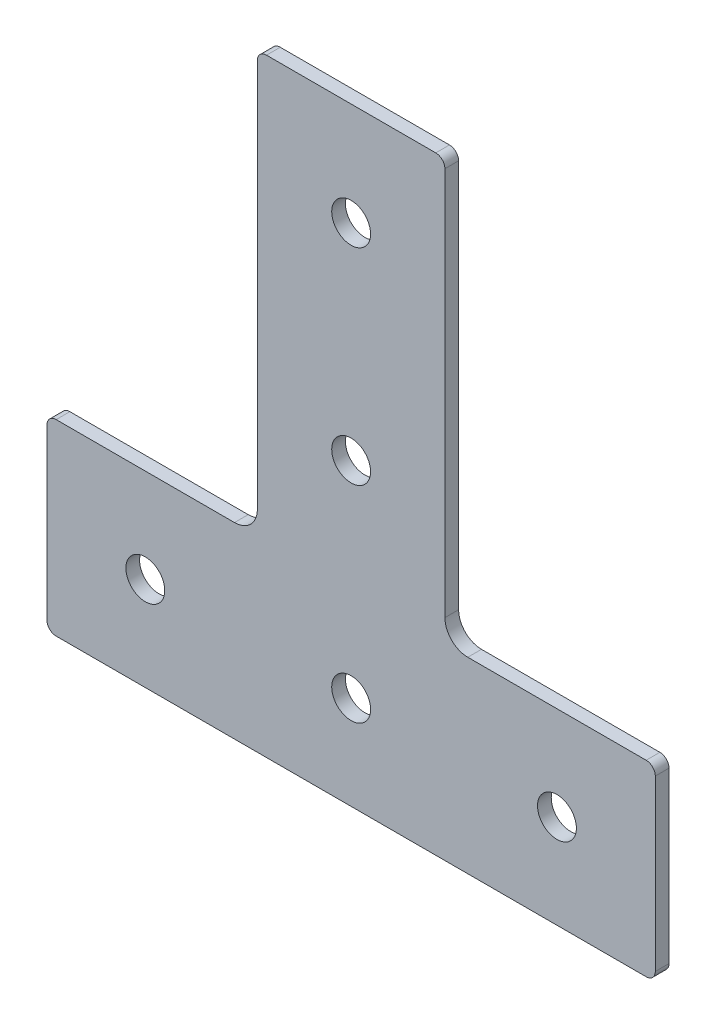
ISO-10303-21;
HEADER;
FILE_DESCRIPTION(('STEP AP214'),'2;1');
FILE_NAME('part.step','',(''),(''),'','','');
FILE_SCHEMA(('AUTOMOTIVE_DESIGN { 1 0 10303 214 1 1 1 1 }'));
ENDSEC;
DATA;
#1=APPLICATION_CONTEXT('core data for automotive mechanical design processes');
#2=APPLICATION_PROTOCOL_DEFINITION('international standard','automotive_design',2000,#1);
#3=PRODUCT_CONTEXT('',#1,'mechanical');
#4=PRODUCT('Part','Part','',(#3));
#5=PRODUCT_RELATED_PRODUCT_CATEGORY('part','',(#4));
#6=PRODUCT_DEFINITION_FORMATION('','',#4);
#7=PRODUCT_DEFINITION_CONTEXT('part definition',#1,'design');
#8=PRODUCT_DEFINITION('design','',#6,#7);
#9=PRODUCT_DEFINITION_SHAPE('','',#8);
#10=(LENGTH_UNIT() NAMED_UNIT(*) SI_UNIT(.MILLI.,.METRE.));
#11=(NAMED_UNIT(*) PLANE_ANGLE_UNIT() SI_UNIT($,.RADIAN.));
#12=(NAMED_UNIT(*) SI_UNIT($,.STERADIAN.) SOLID_ANGLE_UNIT());
#13=UNCERTAINTY_MEASURE_WITH_UNIT(LENGTH_MEASURE(1.E-05),#10,'distance_accuracy_value','');
#14=(GEOMETRIC_REPRESENTATION_CONTEXT(3) GLOBAL_UNCERTAINTY_ASSIGNED_CONTEXT((#13)) GLOBAL_UNIT_ASSIGNED_CONTEXT((#10,
#11,#12)) REPRESENTATION_CONTEXT('',''));
#15=CARTESIAN_POINT('',(0.,0.,0.));
#16=DIRECTION('',(0.,0.,1.));
#17=DIRECTION('',(1.,0.,0.));
#18=AXIS2_PLACEMENT_3D('',#15,#16,#17);
#19=CARTESIAN_POINT('',(-18.5,110.5,0.));
#20=DIRECTION('',(0.,0.,1.));
#21=DIRECTION('',(1.,0.,0.));
#22=AXIS2_PLACEMENT_3D('',#19,#20,#21);
#23=PLANE('',#22);
#24=CARTESIAN_POINT('',(-44.9999999999999,0.,0.));
#25=DIRECTION('',(0.,0.,-1.));
#26=DIRECTION('',(-1.,0.,0.));
#27=AXIS2_PLACEMENT_3D('',#24,#25,#26);
#28=CIRCLE('',#27,4.24999999999986);
#29=CARTESIAN_POINT('',(-49.2499999999998,0.,0.));
#30=VERTEX_POINT('',#29);
#31=EDGE_CURVE('E229',#30,#30,#28,.F.);
#32=ORIENTED_EDGE('',*,*,#31,.T.);
#33=EDGE_LOOP('',(#32));
#34=FACE_BOUND('',#33,.T.);
#35=CARTESIAN_POINT('',(0.,90.,0.));
#36=DIRECTION('',(0.,0.,-1.));
#37=DIRECTION('',(-1.,0.,0.));
#38=AXIS2_PLACEMENT_3D('',#35,#36,#37);
#39=CIRCLE('',#38,4.24999999999986);
#40=CARTESIAN_POINT('',(-4.24999999999986,90.,0.));
#41=VERTEX_POINT('',#40);
#42=EDGE_CURVE('E151',#41,#41,#39,.F.);
#43=ORIENTED_EDGE('',*,*,#42,.T.);
#44=EDGE_LOOP('',(#43));
#45=FACE_BOUND('',#44,.T.);
#46=CARTESIAN_POINT('',(0.,0.,0.));
#47=DIRECTION('',(0.,0.,-1.));
#48=DIRECTION('',(-1.,0.,0.));
#49=AXIS2_PLACEMENT_3D('',#46,#47,#48);
#50=CIRCLE('',#49,4.24999999999986);
#51=CARTESIAN_POINT('',(-4.24999999999986,0.,0.));
#52=VERTEX_POINT('',#51);
#53=EDGE_CURVE('E148',#52,#52,#50,.F.);
#54=ORIENTED_EDGE('',*,*,#53,.T.);
#55=EDGE_LOOP('',(#54));
#56=FACE_BOUND('',#55,.T.);
#57=DIRECTION('',(1.,0.,0.));
#58=VECTOR('',#57,1.);
#59=CARTESIAN_POINT('',(-18.5,112.5,0.));
#60=LINE('',#59,#58);
#61=CARTESIAN_POINT('',(-18.5,112.5,0.));
#62=VERTEX_POINT('',#61);
#63=CARTESIAN_POINT('',(18.5,112.5,0.));
#64=VERTEX_POINT('',#63);
#65=EDGE_CURVE('E131',#62,#64,#60,.T.);
#66=ORIENTED_EDGE('',*,*,#65,.T.);
#67=CARTESIAN_POINT('',(18.5,110.5,0.));
#68=DIRECTION('',(0.,0.,-1.));
#69=DIRECTION('',(-1.,0.,0.));
#70=AXIS2_PLACEMENT_3D('',#67,#68,#69);
#71=CIRCLE('',#70,2.00000000000011);
#72=CARTESIAN_POINT('',(20.5000000000001,110.5,0.));
#73=VERTEX_POINT('',#72);
#74=EDGE_CURVE('E159',#73,#64,#71,.F.);
#75=ORIENTED_EDGE('',*,*,#74,.F.);
#76=DIRECTION('',(0.,1.,0.));
#77=VECTOR('',#76,1.);
#78=CARTESIAN_POINT('',(20.5000000000002,110.5,0.));
#79=LINE('',#78,#77);
#80=CARTESIAN_POINT('',(20.5000000000002,25.5,0.));
#81=VERTEX_POINT('',#80);
#82=EDGE_CURVE('E156',#73,#81,#79,.F.);
#83=ORIENTED_EDGE('',*,*,#82,.T.);
#84=CARTESIAN_POINT('',(25.5000000000001,25.5,0.));
#85=DIRECTION('',(0.,0.,-1.));
#86=DIRECTION('',(-1.,0.,0.));
#87=AXIS2_PLACEMENT_3D('',#84,#85,#86);
#88=CIRCLE('',#87,4.99999999999995);
#89=CARTESIAN_POINT('',(25.5000000000001,20.5,0.));
#90=VERTEX_POINT('',#89);
#91=EDGE_CURVE('E236',#81,#90,#88,.F.);
#92=ORIENTED_EDGE('',*,*,#91,.T.);
#93=DIRECTION('',(1.,0.,0.));
#94=VECTOR('',#93,1.);
#95=CARTESIAN_POINT('',(25.5000000000001,20.5,0.));
#96=LINE('',#95,#94);
#97=CARTESIAN_POINT('',(64.5000000000002,20.5,0.));
#98=VERTEX_POINT('',#97);
#99=EDGE_CURVE('E161',#90,#98,#96,.T.);
#100=ORIENTED_EDGE('',*,*,#99,.T.);
#101=CARTESIAN_POINT('',(64.5000000000002,18.5,0.));
#102=DIRECTION('',(0.,0.,-1.));
#103=DIRECTION('',(-1.,0.,0.));
#104=AXIS2_PLACEMENT_3D('',#101,#102,#103);
#105=CIRCLE('',#104,1.99999999999989);
#106=CARTESIAN_POINT('',(66.5000000000001,18.4999999999999,0.));
#107=VERTEX_POINT('',#106);
#108=EDGE_CURVE('E169',#107,#98,#105,.F.);
#109=ORIENTED_EDGE('',*,*,#108,.F.);
#110=DIRECTION('',(0.,-1.,0.));
#111=VECTOR('',#110,1.);
#112=CARTESIAN_POINT('',(66.5,18.5,0.));
#113=LINE('',#112,#111);
#114=CARTESIAN_POINT('',(66.4999999999996,-18.5000000000001,0.));
#115=VERTEX_POINT('',#114);
#116=EDGE_CURVE('E166',#107,#115,#113,.T.);
#117=ORIENTED_EDGE('',*,*,#116,.T.);
#118=CARTESIAN_POINT('',(64.4999999999998,-18.5000000000001,0.));
#119=DIRECTION('',(0.,0.,-1.));
#120=DIRECTION('',(-1.,0.,0.));
#121=AXIS2_PLACEMENT_3D('',#118,#119,#120);
#122=CIRCLE('',#121,1.99999999999989);
#123=CARTESIAN_POINT('',(64.4999999999998,-20.5,0.));
#124=VERTEX_POINT('',#123);
#125=EDGE_CURVE('E174',#124,#115,#122,.F.);
#126=ORIENTED_EDGE('',*,*,#125,.F.);
#127=DIRECTION('',(1.,0.,0.));
#128=VECTOR('',#127,1.);
#129=CARTESIAN_POINT('',(-64.4999999999998,-20.5000000000001,0.));
#130=LINE('',#129,#128);
#131=CARTESIAN_POINT('',(-64.4999999999998,-20.5000000000001,0.));
#132=VERTEX_POINT('',#131);
#133=EDGE_CURVE('E171',#124,#132,#130,.F.);
#134=ORIENTED_EDGE('',*,*,#133,.T.);
#135=CARTESIAN_POINT('',(-64.4999999999998,-18.5000000000001,0.));
#136=DIRECTION('',(0.,0.,-1.));
#137=DIRECTION('',(-1.,0.,0.));
#138=AXIS2_PLACEMENT_3D('',#135,#136,#137);
#139=CIRCLE('',#138,2.00000000000011);
#140=CARTESIAN_POINT('',(-66.4999999999999,-18.5000000000001,0.));
#141=VERTEX_POINT('',#140);
#142=EDGE_CURVE('E179',#141,#132,#139,.F.);
#143=ORIENTED_EDGE('',*,*,#142,.F.);
#144=DIRECTION('',(0.,1.,0.));
#145=VECTOR('',#144,1.);
#146=CARTESIAN_POINT('',(-66.5,18.5,0.));
#147=LINE('',#146,#145);
#148=CARTESIAN_POINT('',(-66.5,18.5,0.));
#149=VERTEX_POINT('',#148);
#150=EDGE_CURVE('E176',#141,#149,#147,.T.);
#151=ORIENTED_EDGE('',*,*,#150,.T.);
#152=CARTESIAN_POINT('',(-64.4999999999998,18.5,0.));
#153=DIRECTION('',(0.,0.,-1.));
#154=DIRECTION('',(-1.,0.,0.));
#155=AXIS2_PLACEMENT_3D('',#152,#153,#154);
#156=CIRCLE('',#155,2.00000000000011);
#157=CARTESIAN_POINT('',(-64.4999999999998,20.5,0.));
#158=VERTEX_POINT('',#157);
#159=EDGE_CURVE('E184',#158,#149,#156,.F.);
#160=ORIENTED_EDGE('',*,*,#159,.F.);
#161=DIRECTION('',(1.,0.,0.));
#162=VECTOR('',#161,1.);
#163=CARTESIAN_POINT('',(-64.4999999999998,20.5,0.));
#164=LINE('',#163,#162);
#165=CARTESIAN_POINT('',(-25.4999999999996,20.5,0.));
#166=VERTEX_POINT('',#165);
#167=EDGE_CURVE('E181',#158,#166,#164,.T.);
#168=ORIENTED_EDGE('',*,*,#167,.T.);
#169=CARTESIAN_POINT('',(-25.4999999999996,25.5,0.));
#170=DIRECTION('',(0.,0.,-1.));
#171=DIRECTION('',(-1.,0.,0.));
#172=AXIS2_PLACEMENT_3D('',#169,#170,#171);
#173=CIRCLE('',#172,4.99999999999995);
#174=CARTESIAN_POINT('',(-20.4999999999997,25.5,0.));
#175=VERTEX_POINT('',#174);
#176=EDGE_CURVE('E247',#166,#175,#173,.F.);
#177=ORIENTED_EDGE('',*,*,#176,.T.);
#178=DIRECTION('',(0.,1.,0.));
#179=VECTOR('',#178,1.);
#180=CARTESIAN_POINT('',(-20.4999999999997,110.5,0.));
#181=LINE('',#180,#179);
#182=CARTESIAN_POINT('',(-20.4999999999997,110.5,0.));
#183=VERTEX_POINT('',#182);
#184=EDGE_CURVE('E133',#175,#183,#181,.T.);
#185=ORIENTED_EDGE('',*,*,#184,.T.);
#186=CARTESIAN_POINT('',(-18.5,110.5,0.));
#187=DIRECTION('',(0.,0.,-1.));
#188=DIRECTION('',(-1.,0.,0.));
#189=AXIS2_PLACEMENT_3D('',#186,#187,#188);
#190=CIRCLE('',#189,1.99999999999989);
#191=EDGE_CURVE('E127',#62,#183,#190,.F.);
#192=ORIENTED_EDGE('',*,*,#191,.F.);
#193=EDGE_LOOP('',(#66,#75,#83,#92,#100,#109,#117,#126,#134,#143,#151,#160,#168,#177,#185,#192));
#194=FACE_BOUND('',#193,.T.);
#195=CARTESIAN_POINT('',(0.,44.9999999999999,0.));
#196=DIRECTION('',(0.,0.,-1.));
#197=DIRECTION('',(-1.,0.,0.));
#198=AXIS2_PLACEMENT_3D('',#195,#196,#197);
#199=CIRCLE('',#198,4.24999999999986);
#200=CARTESIAN_POINT('',(-4.24999999999986,44.9999999999999,0.));
#201=VERTEX_POINT('',#200);
#202=EDGE_CURVE('E137',#201,#201,#199,.F.);
#203=ORIENTED_EDGE('',*,*,#202,.T.);
#204=EDGE_LOOP('',(#203));
#205=FACE_BOUND('',#204,.T.);
#206=CARTESIAN_POINT('',(45.0000000000004,0.,0.));
#207=DIRECTION('',(0.,0.,-1.));
#208=DIRECTION('',(-1.,0.,0.));
#209=AXIS2_PLACEMENT_3D('',#206,#207,#208);
#210=CIRCLE('',#209,4.24999999999986);
#211=CARTESIAN_POINT('',(40.7500000000005,0.,0.));
#212=VERTEX_POINT('',#211);
#213=EDGE_CURVE('E19',#212,#212,#210,.F.);
#214=ORIENTED_EDGE('',*,*,#213,.T.);
#215=EDGE_LOOP('',(#214));
#216=FACE_BOUND('',#215,.T.);
#217=ADVANCED_FACE('F16',(#34,#45,#56,#194,#205,#216),#23,.F.);
#218=CARTESIAN_POINT('',(45.0000000000004,0.,3.));
#219=DIRECTION('',(0.,0.,-1.));
#220=DIRECTION('',(-1.,0.,0.));
#221=AXIS2_PLACEMENT_3D('',#218,#219,#220);
#222=CYLINDRICAL_SURFACE('',#221,4.24999999999986);
#223=CARTESIAN_POINT('',(45.0000000000004,0.,3.));
#224=DIRECTION('',(0.,0.,-1.));
#225=DIRECTION('',(-1.,0.,0.));
#226=AXIS2_PLACEMENT_3D('',#223,#224,#225);
#227=CIRCLE('',#226,4.24999999999986);
#228=CARTESIAN_POINT('',(40.7500000000005,0.,3.));
#229=VERTEX_POINT('',#228);
#230=EDGE_CURVE('E226',#229,#229,#227,.T.);
#231=ORIENTED_EDGE('',*,*,#230,.F.);
#232=EDGE_LOOP('',(#231));
#233=FACE_BOUND('',#232,.T.);
#234=ORIENTED_EDGE('',*,*,#213,.F.);
#235=EDGE_LOOP('',(#234));
#236=FACE_BOUND('',#235,.T.);
#237=ADVANCED_FACE('F254',(#233,#236),#222,.F.);
#238=CARTESIAN_POINT('',(0.,44.9999999999999,3.));
#239=DIRECTION('',(0.,0.,-1.));
#240=DIRECTION('',(-1.,0.,0.));
#241=AXIS2_PLACEMENT_3D('',#238,#239,#240);
#242=CYLINDRICAL_SURFACE('',#241,4.24999999999986);
#243=CARTESIAN_POINT('',(0.,44.9999999999999,3.));
#244=DIRECTION('',(0.,0.,-1.));
#245=DIRECTION('',(-1.,0.,0.));
#246=AXIS2_PLACEMENT_3D('',#243,#244,#245);
#247=CIRCLE('',#246,4.24999999999986);
#248=CARTESIAN_POINT('',(-4.24999999999986,44.9999999999999,3.));
#249=VERTEX_POINT('',#248);
#250=EDGE_CURVE('E223',#249,#249,#247,.T.);
#251=ORIENTED_EDGE('',*,*,#250,.F.);
#252=EDGE_LOOP('',(#251));
#253=FACE_BOUND('',#252,.T.);
#254=ORIENTED_EDGE('',*,*,#202,.F.);
#255=EDGE_LOOP('',(#254));
#256=FACE_BOUND('',#255,.T.);
#257=ADVANCED_FACE('F256',(#253,#256),#242,.F.);
#258=CARTESIAN_POINT('',(-18.5,110.5,3.));
#259=DIRECTION('',(0.,0.,-1.));
#260=DIRECTION('',(-1.,0.,0.));
#261=AXIS2_PLACEMENT_3D('',#258,#259,#260);
#262=CYLINDRICAL_SURFACE('',#261,1.99999999999989);
#263=CARTESIAN_POINT('',(-18.5,110.5,3.));
#264=DIRECTION('',(0.,0.,-1.));
#265=DIRECTION('',(-1.,0.,0.));
#266=AXIS2_PLACEMENT_3D('',#263,#264,#265);
#267=CIRCLE('',#266,1.99999999999989);
#268=CARTESIAN_POINT('',(-18.5,112.5,3.));
#269=VERTEX_POINT('',#268);
#270=CARTESIAN_POINT('',(-20.4999999999997,110.5,3.));
#271=VERTEX_POINT('',#270);
#272=EDGE_CURVE('E143',#269,#271,#267,.F.);
#273=ORIENTED_EDGE('',*,*,#272,.F.);
#274=DIRECTION('',(0.,0.,-1.));
#275=VECTOR('',#274,1.);
#276=CARTESIAN_POINT('',(-18.5,112.5,3.));
#277=LINE('',#276,#275);
#278=EDGE_CURVE('E140',#269,#62,#277,.T.);
#279=ORIENTED_EDGE('',*,*,#278,.T.);
#280=ORIENTED_EDGE('',*,*,#191,.T.);
#281=DIRECTION('',(0.,0.,-1.));
#282=VECTOR('',#281,1.);
#283=CARTESIAN_POINT('',(-20.4999999999997,110.5,3.));
#284=LINE('',#283,#282);
#285=EDGE_CURVE('E136',#183,#271,#284,.F.);
#286=ORIENTED_EDGE('',*,*,#285,.T.);
#287=EDGE_LOOP('',(#273,#279,#280,#286));
#288=FACE_BOUND('',#287,.T.);
#289=ADVANCED_FACE('F141',(#288),#262,.T.);
#290=CARTESIAN_POINT('',(-20.4999999999997,110.5,3.));
#291=DIRECTION('',(1.,0.,0.));
#292=DIRECTION('',(0.,0.,-1.));
#293=AXIS2_PLACEMENT_3D('',#290,#291,#292);
#294=PLANE('',#293);
#295=DIRECTION('',(0.,0.,-1.));
#296=VECTOR('',#295,1.);
#297=CARTESIAN_POINT('',(-20.4999999999997,25.5,3.));
#298=LINE('',#297,#296);
#299=CARTESIAN_POINT('',(-20.4999999999997,25.5,3.));
#300=VERTEX_POINT('',#299);
#301=EDGE_CURVE('E186',#175,#300,#298,.F.);
#302=ORIENTED_EDGE('',*,*,#301,.T.);
#303=DIRECTION('',(0.,1.,0.));
#304=VECTOR('',#303,1.);
#305=CARTESIAN_POINT('',(-20.4999999999997,110.5,3.));
#306=LINE('',#305,#304);
#307=EDGE_CURVE('E221',#271,#300,#306,.F.);
#308=ORIENTED_EDGE('',*,*,#307,.F.);
#309=ORIENTED_EDGE('',*,*,#285,.F.);
#310=ORIENTED_EDGE('',*,*,#184,.F.);
#311=EDGE_LOOP('',(#302,#308,#309,#310));
#312=FACE_BOUND('',#311,.T.);
#313=ADVANCED_FACE('F339',(#312),#294,.F.);
#314=CARTESIAN_POINT('',(-25.4999999999996,25.5,3.));
#315=DIRECTION('',(0.,0.,-1.));
#316=DIRECTION('',(-1.,0.,0.));
#317=AXIS2_PLACEMENT_3D('',#314,#315,#316);
#318=CYLINDRICAL_SURFACE('',#317,4.99999999999995);
#319=DIRECTION('',(0.,0.,-1.));
#320=VECTOR('',#319,1.);
#321=CARTESIAN_POINT('',(-25.4999999999996,20.5,3.));
#322=LINE('',#321,#320);
#323=CARTESIAN_POINT('',(-25.4999999999996,20.5,3.));
#324=VERTEX_POINT('',#323);
#325=EDGE_CURVE('E185',#166,#324,#322,.F.);
#326=ORIENTED_EDGE('',*,*,#325,.T.);
#327=CARTESIAN_POINT('',(-25.4999999999996,25.5,3.));
#328=DIRECTION('',(0.,0.,-1.));
#329=DIRECTION('',(-1.,0.,0.));
#330=AXIS2_PLACEMENT_3D('',#327,#328,#329);
#331=CIRCLE('',#330,4.99999999999995);
#332=EDGE_CURVE('E218',#300,#324,#331,.T.);
#333=ORIENTED_EDGE('',*,*,#332,.F.);
#334=ORIENTED_EDGE('',*,*,#301,.F.);
#335=ORIENTED_EDGE('',*,*,#176,.F.);
#336=EDGE_LOOP('',(#326,#333,#334,#335));
#337=FACE_BOUND('',#336,.T.);
#338=ADVANCED_FACE('F335',(#337),#318,.F.);
#339=CARTESIAN_POINT('',(-64.4999999999998,20.5,3.));
#340=DIRECTION('',(0.,-1.,0.));
#341=DIRECTION('',(0.,0.,-1.));
#342=AXIS2_PLACEMENT_3D('',#339,#340,#341);
#343=PLANE('',#342);
#344=DIRECTION('',(0.,0.,-1.));
#345=VECTOR('',#344,1.);
#346=CARTESIAN_POINT('',(-64.4999999999998,20.5000000000001,3.));
#347=LINE('',#346,#345);
#348=CARTESIAN_POINT('',(-64.4999999999998,20.5,3.));
#349=VERTEX_POINT('',#348);
#350=EDGE_CURVE('E246',#349,#158,#347,.T.);
#351=ORIENTED_EDGE('',*,*,#350,.F.);
#352=DIRECTION('',(1.,0.,0.));
#353=VECTOR('',#352,1.);
#354=CARTESIAN_POINT('',(-18.5,20.5,3.));
#355=LINE('',#354,#353);
#356=EDGE_CURVE('E217',#324,#349,#355,.F.);
#357=ORIENTED_EDGE('',*,*,#356,.F.);
#358=ORIENTED_EDGE('',*,*,#325,.F.);
#359=ORIENTED_EDGE('',*,*,#167,.F.);
#360=EDGE_LOOP('',(#351,#357,#358,#359));
#361=FACE_BOUND('',#360,.T.);
#362=ADVANCED_FACE('F331',(#361),#343,.F.);
#363=CARTESIAN_POINT('',(-64.4999999999998,18.5,3.));
#364=DIRECTION('',(0.,0.,-1.));
#365=DIRECTION('',(-1.,0.,0.));
#366=AXIS2_PLACEMENT_3D('',#363,#364,#365);
#367=CYLINDRICAL_SURFACE('',#366,2.00000000000011);
#368=CARTESIAN_POINT('',(-64.4999999999998,18.5,3.));
#369=DIRECTION('',(0.,0.,-1.));
#370=DIRECTION('',(-1.,0.,0.));
#371=AXIS2_PLACEMENT_3D('',#368,#369,#370);
#372=CIRCLE('',#371,2.00000000000011);
#373=CARTESIAN_POINT('',(-66.5,18.5,3.));
#374=VERTEX_POINT('',#373);
#375=EDGE_CURVE('E214',#349,#374,#372,.F.);
#376=ORIENTED_EDGE('',*,*,#375,.F.);
#377=ORIENTED_EDGE('',*,*,#350,.T.);
#378=ORIENTED_EDGE('',*,*,#159,.T.);
#379=DIRECTION('',(0.,0.,-1.));
#380=VECTOR('',#379,1.);
#381=CARTESIAN_POINT('',(-66.5,18.5,3.));
#382=LINE('',#381,#380);
#383=EDGE_CURVE('E180',#149,#374,#382,.F.);
#384=ORIENTED_EDGE('',*,*,#383,.T.);
#385=EDGE_LOOP('',(#376,#377,#378,#384));
#386=FACE_BOUND('',#385,.T.);
#387=ADVANCED_FACE('F327',(#386),#367,.T.);
#388=CARTESIAN_POINT('',(-66.5,18.5,3.));
#389=DIRECTION('',(1.,0.,0.));
#390=DIRECTION('',(0.,0.,-1.));
#391=AXIS2_PLACEMENT_3D('',#388,#389,#390);
#392=PLANE('',#391);
#393=DIRECTION('',(0.,0.,-1.));
#394=VECTOR('',#393,1.);
#395=CARTESIAN_POINT('',(-66.4999999999999,-18.5000000000001,3.));
#396=LINE('',#395,#394);
#397=CARTESIAN_POINT('',(-66.4999999999999,-18.5000000000001,3.));
#398=VERTEX_POINT('',#397);
#399=EDGE_CURVE('E244',#398,#141,#396,.T.);
#400=ORIENTED_EDGE('',*,*,#399,.F.);
#401=DIRECTION('',(0.,1.,0.));
#402=VECTOR('',#401,1.);
#403=CARTESIAN_POINT('',(-66.5,110.5,3.));
#404=LINE('',#403,#402);
#405=EDGE_CURVE('E213',#374,#398,#404,.F.);
#406=ORIENTED_EDGE('',*,*,#405,.F.);
#407=ORIENTED_EDGE('',*,*,#383,.F.);
#408=ORIENTED_EDGE('',*,*,#150,.F.);
#409=EDGE_LOOP('',(#400,#406,#407,#408));
#410=FACE_BOUND('',#409,.T.);
#411=ADVANCED_FACE('F323',(#410),#392,.F.);
#412=CARTESIAN_POINT('',(-64.4999999999998,-18.5000000000001,3.));
#413=DIRECTION('',(0.,0.,-1.));
#414=DIRECTION('',(-1.,0.,0.));
#415=AXIS2_PLACEMENT_3D('',#412,#413,#414);
#416=CYLINDRICAL_SURFACE('',#415,2.00000000000011);
#417=CARTESIAN_POINT('',(-64.4999999999998,-18.5000000000001,3.));
#418=DIRECTION('',(0.,0.,-1.));
#419=DIRECTION('',(-1.,0.,0.));
#420=AXIS2_PLACEMENT_3D('',#417,#418,#419);
#421=CIRCLE('',#420,2.00000000000011);
#422=CARTESIAN_POINT('',(-64.4999999999998,-20.5000000000001,3.));
#423=VERTEX_POINT('',#422);
#424=EDGE_CURVE('E210',#398,#423,#421,.F.);
#425=ORIENTED_EDGE('',*,*,#424,.F.);
#426=ORIENTED_EDGE('',*,*,#399,.T.);
#427=ORIENTED_EDGE('',*,*,#142,.T.);
#428=DIRECTION('',(0.,0.,1.));
#429=VECTOR('',#428,1.);
#430=CARTESIAN_POINT('',(-64.4999999999998,-20.5000000000001,3.));
#431=LINE('',#430,#429);
#432=EDGE_CURVE('E175',#132,#423,#431,.T.);
#433=ORIENTED_EDGE('',*,*,#432,.T.);
#434=EDGE_LOOP('',(#425,#426,#427,#433));
#435=FACE_BOUND('',#434,.T.);
#436=ADVANCED_FACE('F319',(#435),#416,.T.);
#437=CARTESIAN_POINT('',(-64.4999999999998,-20.5000000000001,3.));
#438=DIRECTION('',(0.,1.,0.));
#439=DIRECTION('',(0.,0.,1.));
#440=AXIS2_PLACEMENT_3D('',#437,#438,#439);
#441=PLANE('',#440);
#442=DIRECTION('',(0.,0.,-1.));
#443=VECTOR('',#442,1.);
#444=CARTESIAN_POINT('',(64.4999999999998,-20.5,3.));
#445=LINE('',#444,#443);
#446=CARTESIAN_POINT('',(64.4999999999998,-20.5,3.));
#447=VERTEX_POINT('',#446);
#448=EDGE_CURVE('E242',#447,#124,#445,.T.);
#449=ORIENTED_EDGE('',*,*,#448,.F.);
#450=DIRECTION('',(1.,0.,0.));
#451=VECTOR('',#450,1.);
#452=CARTESIAN_POINT('',(-18.5,-20.5000000000001,3.));
#453=LINE('',#452,#451);
#454=EDGE_CURVE('E209',#423,#447,#453,.T.);
#455=ORIENTED_EDGE('',*,*,#454,.F.);
#456=ORIENTED_EDGE('',*,*,#432,.F.);
#457=ORIENTED_EDGE('',*,*,#133,.F.);
#458=EDGE_LOOP('',(#449,#455,#456,#457));
#459=FACE_BOUND('',#458,.T.);
#460=ADVANCED_FACE('F315',(#459),#441,.F.);
#461=CARTESIAN_POINT('',(64.4999999999998,-18.5000000000001,3.));
#462=DIRECTION('',(0.,0.,-1.));
#463=DIRECTION('',(-1.,0.,0.));
#464=AXIS2_PLACEMENT_3D('',#461,#462,#463);
#465=CYLINDRICAL_SURFACE('',#464,1.99999999999989);
#466=CARTESIAN_POINT('',(64.4999999999998,-18.5000000000001,3.));
#467=DIRECTION('',(0.,0.,-1.));
#468=DIRECTION('',(-1.,0.,0.));
#469=AXIS2_PLACEMENT_3D('',#466,#467,#468);
#470=CIRCLE('',#469,1.99999999999989);
#471=CARTESIAN_POINT('',(66.4999999999996,-18.5000000000001,3.));
#472=VERTEX_POINT('',#471);
#473=EDGE_CURVE('E206',#447,#472,#470,.F.);
#474=ORIENTED_EDGE('',*,*,#473,.F.);
#475=ORIENTED_EDGE('',*,*,#448,.T.);
#476=ORIENTED_EDGE('',*,*,#125,.T.);
#477=DIRECTION('',(0.,0.,1.));
#478=VECTOR('',#477,1.);
#479=CARTESIAN_POINT('',(66.4999999999996,-18.5000000000001,3.));
#480=LINE('',#479,#478);
#481=EDGE_CURVE('E170',#115,#472,#480,.T.);
#482=ORIENTED_EDGE('',*,*,#481,.T.);
#483=EDGE_LOOP('',(#474,#475,#476,#482));
#484=FACE_BOUND('',#483,.T.);
#485=ADVANCED_FACE('F311',(#484),#465,.T.);
#486=CARTESIAN_POINT('',(66.5,18.5,3.));
#487=DIRECTION('',(-1.,0.,0.));
#488=DIRECTION('',(0.,-1.,0.));
#489=AXIS2_PLACEMENT_3D('',#486,#487,#488);
#490=PLANE('',#489);
#491=DIRECTION('',(0.,0.,-1.));
#492=VECTOR('',#491,1.);
#493=CARTESIAN_POINT('',(66.5000000000001,18.5,3.));
#494=LINE('',#493,#492);
#495=CARTESIAN_POINT('',(66.4999999999998,18.5,3.));
#496=VERTEX_POINT('',#495);
#497=EDGE_CURVE('E240',#496,#107,#494,.T.);
#498=ORIENTED_EDGE('',*,*,#497,.F.);
#499=DIRECTION('',(0.,1.,0.));
#500=VECTOR('',#499,1.);
#501=CARTESIAN_POINT('',(66.4999999999996,110.5,3.));
#502=LINE('',#501,#500);
#503=EDGE_CURVE('E205',#472,#496,#502,.T.);
#504=ORIENTED_EDGE('',*,*,#503,.F.);
#505=ORIENTED_EDGE('',*,*,#481,.F.);
#506=ORIENTED_EDGE('',*,*,#116,.F.);
#507=EDGE_LOOP('',(#498,#504,#505,#506));
#508=FACE_BOUND('',#507,.T.);
#509=ADVANCED_FACE('F307',(#508),#490,.F.);
#510=CARTESIAN_POINT('',(64.5000000000002,18.5,3.));
#511=DIRECTION('',(0.,0.,-1.));
#512=DIRECTION('',(-1.,0.,0.));
#513=AXIS2_PLACEMENT_3D('',#510,#511,#512);
#514=CYLINDRICAL_SURFACE('',#513,1.99999999999989);
#515=CARTESIAN_POINT('',(64.5000000000002,18.5,3.));
#516=DIRECTION('',(0.,0.,-1.));
#517=DIRECTION('',(-1.,0.,0.));
#518=AXIS2_PLACEMENT_3D('',#515,#516,#517);
#519=CIRCLE('',#518,1.99999999999989);
#520=CARTESIAN_POINT('',(64.5000000000002,20.5,3.));
#521=VERTEX_POINT('',#520);
#522=EDGE_CURVE('E202',#496,#521,#519,.F.);
#523=ORIENTED_EDGE('',*,*,#522,.F.);
#524=ORIENTED_EDGE('',*,*,#497,.T.);
#525=ORIENTED_EDGE('',*,*,#108,.T.);
#526=DIRECTION('',(0.,0.,-1.));
#527=VECTOR('',#526,1.);
#528=CARTESIAN_POINT('',(64.5000000000002,20.5,3.));
#529=LINE('',#528,#527);
#530=EDGE_CURVE('E165',#98,#521,#529,.F.);
#531=ORIENTED_EDGE('',*,*,#530,.T.);
#532=EDGE_LOOP('',(#523,#524,#525,#531));
#533=FACE_BOUND('',#532,.T.);
#534=ADVANCED_FACE('F303',(#533),#514,.T.);
#535=CARTESIAN_POINT('',(25.5000000000001,20.5,3.));
#536=DIRECTION('',(0.,-1.,0.));
#537=DIRECTION('',(0.,0.,-1.));
#538=AXIS2_PLACEMENT_3D('',#535,#536,#537);
#539=PLANE('',#538);
#540=DIRECTION('',(0.,0.,-1.));
#541=VECTOR('',#540,1.);
#542=CARTESIAN_POINT('',(25.5000000000001,20.5,3.));
#543=LINE('',#542,#541);
#544=CARTESIAN_POINT('',(25.5000000000001,20.5,3.));
#545=VERTEX_POINT('',#544);
#546=EDGE_CURVE('E164',#90,#545,#543,.F.);
#547=ORIENTED_EDGE('',*,*,#546,.T.);
#548=DIRECTION('',(1.,0.,0.));
#549=VECTOR('',#548,1.);
#550=CARTESIAN_POINT('',(-18.5,20.5,3.));
#551=LINE('',#550,#549);
#552=EDGE_CURVE('E201',#521,#545,#551,.F.);
#553=ORIENTED_EDGE('',*,*,#552,.F.);
#554=ORIENTED_EDGE('',*,*,#530,.F.);
#555=ORIENTED_EDGE('',*,*,#99,.F.);
#556=EDGE_LOOP('',(#547,#553,#554,#555));
#557=FACE_BOUND('',#556,.T.);
#558=ADVANCED_FACE('F299',(#557),#539,.F.);
#559=CARTESIAN_POINT('',(25.5000000000001,25.5,3.));
#560=DIRECTION('',(0.,0.,-1.));
#561=DIRECTION('',(-1.,0.,0.));
#562=AXIS2_PLACEMENT_3D('',#559,#560,#561);
#563=CYLINDRICAL_SURFACE('',#562,4.99999999999995);
#564=DIRECTION('',(0.,0.,1.));
#565=VECTOR('',#564,1.);
#566=CARTESIAN_POINT('',(20.5000000000002,25.5,3.));
#567=LINE('',#566,#565);
#568=CARTESIAN_POINT('',(20.5000000000002,25.5,3.));
#569=VERTEX_POINT('',#568);
#570=EDGE_CURVE('E160',#81,#569,#567,.T.);
#571=ORIENTED_EDGE('',*,*,#570,.T.);
#572=CARTESIAN_POINT('',(25.5000000000001,25.5,3.));
#573=DIRECTION('',(0.,0.,-1.));
#574=DIRECTION('',(-1.,0.,0.));
#575=AXIS2_PLACEMENT_3D('',#572,#573,#574);
#576=CIRCLE('',#575,4.99999999999995);
#577=EDGE_CURVE('E198',#545,#569,#576,.T.);
#578=ORIENTED_EDGE('',*,*,#577,.F.);
#579=ORIENTED_EDGE('',*,*,#546,.F.);
#580=ORIENTED_EDGE('',*,*,#91,.F.);
#581=EDGE_LOOP('',(#571,#578,#579,#580));
#582=FACE_BOUND('',#581,.T.);
#583=ADVANCED_FACE('F295',(#582),#563,.F.);
#584=CARTESIAN_POINT('',(20.5000000000002,110.5,3.));
#585=DIRECTION('',(-1.,0.,0.));
#586=DIRECTION('',(0.,0.,1.));
#587=AXIS2_PLACEMENT_3D('',#584,#585,#586);
#588=PLANE('',#587);
#589=DIRECTION('',(0.,0.,-1.));
#590=VECTOR('',#589,1.);
#591=CARTESIAN_POINT('',(20.5000000000001,110.5,3.));
#592=LINE('',#591,#590);
#593=CARTESIAN_POINT('',(20.5000000000001,110.5,3.));
#594=VERTEX_POINT('',#593);
#595=EDGE_CURVE('E235',#594,#73,#592,.T.);
#596=ORIENTED_EDGE('',*,*,#595,.F.);
#597=DIRECTION('',(0.,1.,0.));
#598=VECTOR('',#597,1.);
#599=CARTESIAN_POINT('',(20.5000000000002,110.5,3.));
#600=LINE('',#599,#598);
#601=EDGE_CURVE('E197',#569,#594,#600,.T.);
#602=ORIENTED_EDGE('',*,*,#601,.F.);
#603=ORIENTED_EDGE('',*,*,#570,.F.);
#604=ORIENTED_EDGE('',*,*,#82,.F.);
#605=EDGE_LOOP('',(#596,#602,#603,#604));
#606=FACE_BOUND('',#605,.T.);
#607=ADVANCED_FACE('F292',(#606),#588,.F.);
#608=CARTESIAN_POINT('',(18.5,110.5,3.));
#609=DIRECTION('',(0.,0.,-1.));
#610=DIRECTION('',(-1.,0.,0.));
#611=AXIS2_PLACEMENT_3D('',#608,#609,#610);
#612=CYLINDRICAL_SURFACE('',#611,2.00000000000011);
#613=CARTESIAN_POINT('',(18.5,110.5,3.));
#614=DIRECTION('',(0.,0.,-1.));
#615=DIRECTION('',(-1.,0.,0.));
#616=AXIS2_PLACEMENT_3D('',#613,#614,#615);
#617=CIRCLE('',#616,2.00000000000011);
#618=CARTESIAN_POINT('',(18.5,112.5,3.));
#619=VERTEX_POINT('',#618);
#620=EDGE_CURVE('E194',#594,#619,#617,.F.);
#621=ORIENTED_EDGE('',*,*,#620,.F.);
#622=ORIENTED_EDGE('',*,*,#595,.T.);
#623=ORIENTED_EDGE('',*,*,#74,.T.);
#624=DIRECTION('',(0.,0.,-1.));
#625=VECTOR('',#624,1.);
#626=CARTESIAN_POINT('',(18.5,112.5,3.));
#627=LINE('',#626,#625);
#628=EDGE_CURVE('E34',#64,#619,#627,.F.);
#629=ORIENTED_EDGE('',*,*,#628,.T.);
#630=EDGE_LOOP('',(#621,#622,#623,#629));
#631=FACE_BOUND('',#630,.T.);
#632=ADVANCED_FACE('F289',(#631),#612,.T.);
#633=CARTESIAN_POINT('',(-18.5,112.5,3.));
#634=DIRECTION('',(0.,-1.,0.));
#635=DIRECTION('',(0.,0.,-1.));
#636=AXIS2_PLACEMENT_3D('',#633,#634,#635);
#637=PLANE('',#636);
#638=ORIENTED_EDGE('',*,*,#278,.F.);
#639=DIRECTION('',(1.,0.,0.));
#640=VECTOR('',#639,1.);
#641=CARTESIAN_POINT('',(-18.5,112.5,3.));
#642=LINE('',#641,#640);
#643=EDGE_CURVE('E193',#619,#269,#642,.F.);
#644=ORIENTED_EDGE('',*,*,#643,.F.);
#645=ORIENTED_EDGE('',*,*,#628,.F.);
#646=ORIENTED_EDGE('',*,*,#65,.F.);
#647=EDGE_LOOP('',(#638,#644,#645,#646));
#648=FACE_BOUND('',#647,.T.);
#649=ADVANCED_FACE('F147',(#648),#637,.F.);
#650=CARTESIAN_POINT('',(0.,0.,3.));
#651=DIRECTION('',(0.,0.,-1.));
#652=DIRECTION('',(-1.,0.,0.));
#653=AXIS2_PLACEMENT_3D('',#650,#651,#652);
#654=CYLINDRICAL_SURFACE('',#653,4.24999999999986);
#655=CARTESIAN_POINT('',(0.,0.,3.));
#656=DIRECTION('',(0.,0.,-1.));
#657=DIRECTION('',(-1.,0.,0.));
#658=AXIS2_PLACEMENT_3D('',#655,#656,#657);
#659=CIRCLE('',#658,4.24999999999986);
#660=CARTESIAN_POINT('',(-4.24999999999986,0.,3.));
#661=VERTEX_POINT('',#660);
#662=EDGE_CURVE('E190',#661,#661,#659,.T.);
#663=ORIENTED_EDGE('',*,*,#662,.F.);
#664=EDGE_LOOP('',(#663));
#665=FACE_BOUND('',#664,.T.);
#666=ORIENTED_EDGE('',*,*,#53,.F.);
#667=EDGE_LOOP('',(#666));
#668=FACE_BOUND('',#667,.T.);
#669=ADVANCED_FACE('F282',(#665,#668),#654,.F.);
#670=CARTESIAN_POINT('',(0.,90.,3.));
#671=DIRECTION('',(0.,0.,-1.));
#672=DIRECTION('',(-1.,0.,0.));
#673=AXIS2_PLACEMENT_3D('',#670,#671,#672);
#674=CYLINDRICAL_SURFACE('',#673,4.24999999999986);
#675=CARTESIAN_POINT('',(0.,90.,3.));
#676=DIRECTION('',(0.,0.,-1.));
#677=DIRECTION('',(-1.,0.,0.));
#678=AXIS2_PLACEMENT_3D('',#675,#676,#677);
#679=CIRCLE('',#678,4.24999999999986);
#680=CARTESIAN_POINT('',(-4.24999999999986,90.,3.));
#681=VERTEX_POINT('',#680);
#682=EDGE_CURVE('E25',#681,#681,#679,.T.);
#683=ORIENTED_EDGE('',*,*,#682,.F.);
#684=EDGE_LOOP('',(#683));
#685=FACE_BOUND('',#684,.T.);
#686=ORIENTED_EDGE('',*,*,#42,.F.);
#687=EDGE_LOOP('',(#686));
#688=FACE_BOUND('',#687,.T.);
#689=ADVANCED_FACE('F275',(#685,#688),#674,.F.);
#690=CARTESIAN_POINT('',(-44.9999999999999,0.,3.));
#691=DIRECTION('',(0.,0.,-1.));
#692=DIRECTION('',(-1.,0.,0.));
#693=AXIS2_PLACEMENT_3D('',#690,#691,#692);
#694=CYLINDRICAL_SURFACE('',#693,4.24999999999986);
#695=CARTESIAN_POINT('',(-44.9999999999999,0.,3.));
#696=DIRECTION('',(0.,0.,-1.));
#697=DIRECTION('',(-1.,0.,0.));
#698=AXIS2_PLACEMENT_3D('',#695,#696,#697);
#699=CIRCLE('',#698,4.24999999999986);
#700=CARTESIAN_POINT('',(-49.2499999999998,0.,3.));
#701=VERTEX_POINT('',#700);
#702=EDGE_CURVE('E10',#701,#701,#699,.T.);
#703=ORIENTED_EDGE('',*,*,#702,.F.);
#704=EDGE_LOOP('',(#703));
#705=FACE_BOUND('',#704,.T.);
#706=ORIENTED_EDGE('',*,*,#31,.F.);
#707=EDGE_LOOP('',(#706));
#708=FACE_BOUND('',#707,.T.);
#709=ADVANCED_FACE('F269',(#705,#708),#694,.F.);
#710=CARTESIAN_POINT('',(-18.5,110.5,3.));
#711=DIRECTION('',(0.,0.,1.));
#712=DIRECTION('',(1.,0.,0.));
#713=AXIS2_PLACEMENT_3D('',#710,#711,#712);
#714=PLANE('',#713);
#715=ORIENTED_EDGE('',*,*,#702,.T.);
#716=EDGE_LOOP('',(#715));
#717=FACE_BOUND('',#716,.T.);
#718=ORIENTED_EDGE('',*,*,#682,.T.);
#719=EDGE_LOOP('',(#718));
#720=FACE_BOUND('',#719,.T.);
#721=ORIENTED_EDGE('',*,*,#662,.T.);
#722=EDGE_LOOP('',(#721));
#723=FACE_BOUND('',#722,.T.);
#724=ORIENTED_EDGE('',*,*,#620,.T.);
#725=ORIENTED_EDGE('',*,*,#643,.T.);
#726=ORIENTED_EDGE('',*,*,#272,.T.);
#727=ORIENTED_EDGE('',*,*,#307,.T.);
#728=ORIENTED_EDGE('',*,*,#332,.T.);
#729=ORIENTED_EDGE('',*,*,#356,.T.);
#730=ORIENTED_EDGE('',*,*,#375,.T.);
#731=ORIENTED_EDGE('',*,*,#405,.T.);
#732=ORIENTED_EDGE('',*,*,#424,.T.);
#733=ORIENTED_EDGE('',*,*,#454,.T.);
#734=ORIENTED_EDGE('',*,*,#473,.T.);
#735=ORIENTED_EDGE('',*,*,#503,.T.);
#736=ORIENTED_EDGE('',*,*,#522,.T.);
#737=ORIENTED_EDGE('',*,*,#552,.T.);
#738=ORIENTED_EDGE('',*,*,#577,.T.);
#739=ORIENTED_EDGE('',*,*,#601,.T.);
#740=EDGE_LOOP('',(#724,#725,#726,#727,#728,#729,#730,#731,#732,#733,#734,#735,#736,#737,#738,#739));
#741=FACE_BOUND('',#740,.T.);
#742=ORIENTED_EDGE('',*,*,#250,.T.);
#743=EDGE_LOOP('',(#742));
#744=FACE_BOUND('',#743,.T.);
#745=ORIENTED_EDGE('',*,*,#230,.T.);
#746=EDGE_LOOP('',(#745));
#747=FACE_BOUND('',#746,.T.);
#748=ADVANCED_FACE('F267',(#717,#720,#723,#741,#744,#747),#714,.T.);
#749=CLOSED_SHELL('',(#217,#237,#257,#289,#313,#338,#362,#387,#411,#436,#460,#485,#509,#534,
#558,#583,#607,#632,#649,#669,#689,#709,#748));
#750=MANIFOLD_SOLID_BREP('B1',#749);
#751=ADVANCED_BREP_SHAPE_REPRESENTATION('',(#18,#750),#14);
#752=SHAPE_DEFINITION_REPRESENTATION(#9,#751);
ENDSEC;
END-ISO-10303-21;
